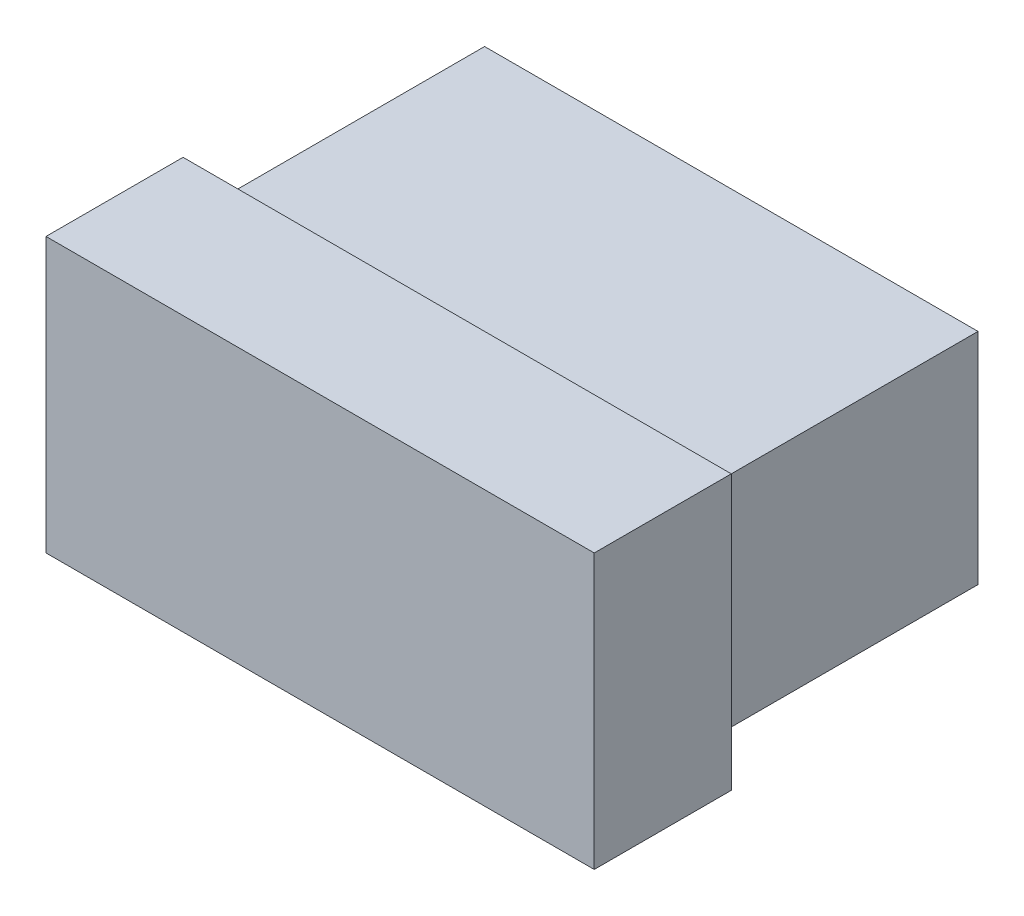
ISO-10303-21;
HEADER;
FILE_DESCRIPTION(('STEP AP214'),'2;1');
FILE_NAME('part.step','',(''),(''),'','','');
FILE_SCHEMA(('AUTOMOTIVE_DESIGN { 1 0 10303 214 1 1 1 1 }'));
ENDSEC;
DATA;
#1=APPLICATION_CONTEXT('core data for automotive mechanical design processes');
#2=APPLICATION_PROTOCOL_DEFINITION('international standard','automotive_design',2000,#1);
#3=PRODUCT_CONTEXT('',#1,'mechanical');
#4=PRODUCT('Part','Part','',(#3));
#5=PRODUCT_RELATED_PRODUCT_CATEGORY('part','',(#4));
#6=PRODUCT_DEFINITION_FORMATION('','',#4);
#7=PRODUCT_DEFINITION_CONTEXT('part definition',#1,'design');
#8=PRODUCT_DEFINITION('design','',#6,#7);
#9=PRODUCT_DEFINITION_SHAPE('','',#8);
#10=(LENGTH_UNIT() NAMED_UNIT(*) SI_UNIT(.MILLI.,.METRE.));
#11=(NAMED_UNIT(*) PLANE_ANGLE_UNIT() SI_UNIT($,.RADIAN.));
#12=(NAMED_UNIT(*) SI_UNIT($,.STERADIAN.) SOLID_ANGLE_UNIT());
#13=UNCERTAINTY_MEASURE_WITH_UNIT(LENGTH_MEASURE(1.E-05),#10,'distance_accuracy_value','');
#14=(GEOMETRIC_REPRESENTATION_CONTEXT(3) GLOBAL_UNCERTAINTY_ASSIGNED_CONTEXT((#13)) GLOBAL_UNIT_ASSIGNED_CONTEXT((#10,
#11,#12)) REPRESENTATION_CONTEXT('',''));
#15=CARTESIAN_POINT('',(0.,0.,0.));
#16=DIRECTION('',(0.,0.,1.));
#17=DIRECTION('',(1.,0.,0.));
#18=AXIS2_PLACEMENT_3D('',#15,#16,#17);
#19=CARTESIAN_POINT('',(-11.43,5.08,-12.7));
#20=DIRECTION('',(-1.,0.,0.));
#21=DIRECTION('',(0.,0.,1.));
#22=AXIS2_PLACEMENT_3D('',#19,#20,#21);
#23=PLANE('',#22);
#24=DIRECTION('',(0.,-1.,0.));
#25=VECTOR('',#24,1.);
#26=CARTESIAN_POINT('',(-11.43,5.08,0.));
#27=LINE('',#26,#25);
#28=CARTESIAN_POINT('',(-11.43,5.08,0.));
#29=VERTEX_POINT('',#28);
#30=CARTESIAN_POINT('',(-11.43,-5.08,0.));
#31=VERTEX_POINT('',#30);
#32=EDGE_CURVE('E142',#29,#31,#27,.T.);
#33=ORIENTED_EDGE('',*,*,#32,.F.);
#34=DIRECTION('',(0.,0.,1.));
#35=VECTOR('',#34,1.);
#36=CARTESIAN_POINT('',(-11.43,5.08,-12.7));
#37=LINE('',#36,#35);
#38=CARTESIAN_POINT('',(-11.43,5.08,-12.7));
#39=VERTEX_POINT('',#38);
#40=EDGE_CURVE('E11',#39,#29,#37,.T.);
#41=ORIENTED_EDGE('',*,*,#40,.F.);
#42=DIRECTION('',(0.,-1.,0.));
#43=VECTOR('',#42,1.);
#44=CARTESIAN_POINT('',(-11.43,5.08,-12.7));
#45=LINE('',#44,#43);
#46=CARTESIAN_POINT('',(-11.43,-5.08,-12.7));
#47=VERTEX_POINT('',#46);
#48=EDGE_CURVE('E153',#39,#47,#45,.T.);
#49=ORIENTED_EDGE('',*,*,#48,.T.);
#50=DIRECTION('',(0.,0.,1.));
#51=VECTOR('',#50,1.);
#52=CARTESIAN_POINT('',(-11.43,-5.08,-12.7));
#53=LINE('',#52,#51);
#54=EDGE_CURVE('E46',#47,#31,#53,.T.);
#55=ORIENTED_EDGE('',*,*,#54,.T.);
#56=EDGE_LOOP('',(#33,#41,#49,#55));
#57=FACE_BOUND('',#56,.T.);
#58=ADVANCED_FACE('F43',(#57),#23,.T.);
#59=CARTESIAN_POINT('',(-11.43,5.08,-12.7));
#60=DIRECTION('',(0.,1.,0.));
#61=DIRECTION('',(0.,0.,1.));
#62=AXIS2_PLACEMENT_3D('',#59,#60,#61);
#63=PLANE('',#62);
#64=DIRECTION('',(-1.,0.,0.));
#65=VECTOR('',#64,1.);
#66=CARTESIAN_POINT('',(-11.43,5.08,0.));
#67=LINE('',#66,#65);
#68=CARTESIAN_POINT('',(11.43,5.08,0.));
#69=VERTEX_POINT('',#68);
#70=EDGE_CURVE('E157',#69,#29,#67,.T.);
#71=ORIENTED_EDGE('',*,*,#70,.F.);
#72=DIRECTION('',(0.,0.,1.));
#73=VECTOR('',#72,1.);
#74=CARTESIAN_POINT('',(11.43,5.08,-12.7));
#75=LINE('',#74,#73);
#76=CARTESIAN_POINT('',(11.43,5.08,-12.7));
#77=VERTEX_POINT('',#76);
#78=EDGE_CURVE('E53',#77,#69,#75,.T.);
#79=ORIENTED_EDGE('',*,*,#78,.F.);
#80=DIRECTION('',(-1.,0.,0.));
#81=VECTOR('',#80,1.);
#82=CARTESIAN_POINT('',(-11.43,5.08,-12.7));
#83=LINE('',#82,#81);
#84=EDGE_CURVE('E163',#77,#39,#83,.T.);
#85=ORIENTED_EDGE('',*,*,#84,.T.);
#86=ORIENTED_EDGE('',*,*,#40,.T.);
#87=EDGE_LOOP('',(#71,#79,#85,#86));
#88=FACE_BOUND('',#87,.T.);
#89=ADVANCED_FACE('F184',(#88),#63,.T.);
#90=CARTESIAN_POINT('',(11.43,5.08,-12.7));
#91=DIRECTION('',(1.,0.,0.));
#92=DIRECTION('',(0.,0.,-1.));
#93=AXIS2_PLACEMENT_3D('',#90,#91,#92);
#94=PLANE('',#93);
#95=DIRECTION('',(0.,1.,0.));
#96=VECTOR('',#95,1.);
#97=CARTESIAN_POINT('',(11.43,5.08,0.));
#98=LINE('',#97,#96);
#99=CARTESIAN_POINT('',(11.43,-5.08,0.));
#100=VERTEX_POINT('',#99);
#101=EDGE_CURVE('E170',#100,#69,#98,.T.);
#102=ORIENTED_EDGE('',*,*,#101,.F.);
#103=DIRECTION('',(0.,0.,1.));
#104=VECTOR('',#103,1.);
#105=CARTESIAN_POINT('',(11.43,-5.08,-12.7));
#106=LINE('',#105,#104);
#107=CARTESIAN_POINT('',(11.43,-5.08,-12.7));
#108=VERTEX_POINT('',#107);
#109=EDGE_CURVE('E76',#108,#100,#106,.T.);
#110=ORIENTED_EDGE('',*,*,#109,.F.);
#111=DIRECTION('',(0.,1.,0.));
#112=VECTOR('',#111,1.);
#113=CARTESIAN_POINT('',(11.43,5.08,-12.7));
#114=LINE('',#113,#112);
#115=EDGE_CURVE('E160',#108,#77,#114,.T.);
#116=ORIENTED_EDGE('',*,*,#115,.T.);
#117=ORIENTED_EDGE('',*,*,#78,.T.);
#118=EDGE_LOOP('',(#102,#110,#116,#117));
#119=FACE_BOUND('',#118,.T.);
#120=ADVANCED_FACE('F189',(#119),#94,.T.);
#121=CARTESIAN_POINT('',(-11.43,-5.08,-12.7));
#122=DIRECTION('',(0.,-1.,0.));
#123=DIRECTION('',(1.,0.,0.));
#124=AXIS2_PLACEMENT_3D('',#121,#122,#123);
#125=PLANE('',#124);
#126=DIRECTION('',(1.,0.,0.));
#127=VECTOR('',#126,1.);
#128=CARTESIAN_POINT('',(-11.43,-5.08,0.));
#129=LINE('',#128,#127);
#130=EDGE_CURVE('E147',#31,#100,#129,.T.);
#131=ORIENTED_EDGE('',*,*,#130,.F.);
#132=ORIENTED_EDGE('',*,*,#54,.F.);
#133=DIRECTION('',(1.,0.,0.));
#134=VECTOR('',#133,1.);
#135=CARTESIAN_POINT('',(-11.43,-5.08,-12.7));
#136=LINE('',#135,#134);
#137=EDGE_CURVE('E156',#47,#108,#136,.T.);
#138=ORIENTED_EDGE('',*,*,#137,.T.);
#139=ORIENTED_EDGE('',*,*,#109,.T.);
#140=EDGE_LOOP('',(#131,#132,#138,#139));
#141=FACE_BOUND('',#140,.T.);
#142=ADVANCED_FACE('F180',(#141),#125,.T.);
#143=CARTESIAN_POINT('',(0.,0.,-12.7));
#144=DIRECTION('',(0.,0.,1.));
#145=DIRECTION('',(1.,0.,0.));
#146=AXIS2_PLACEMENT_3D('',#143,#144,#145);
#147=PLANE('',#146);
#148=ORIENTED_EDGE('',*,*,#48,.F.);
#149=ORIENTED_EDGE('',*,*,#84,.F.);
#150=ORIENTED_EDGE('',*,*,#115,.F.);
#151=ORIENTED_EDGE('',*,*,#137,.F.);
#152=EDGE_LOOP('',(#148,#149,#150,#151));
#153=FACE_BOUND('',#152,.T.);
#154=ADVANCED_FACE('F188',(#153),#147,.F.);
#155=CARTESIAN_POINT('',(0.,0.,0.));
#156=DIRECTION('',(0.,0.,1.));
#157=DIRECTION('',(1.,0.,0.));
#158=AXIS2_PLACEMENT_3D('',#155,#156,#157);
#159=PLANE('',#158);
#160=DIRECTION('',(0.,-1.,0.));
#161=VECTOR('',#160,1.);
#162=CARTESIAN_POINT('',(-12.7,6.35,0.));
#163=LINE('',#162,#161);
#164=CARTESIAN_POINT('',(-12.7,6.35,0.));
#165=VERTEX_POINT('',#164);
#166=CARTESIAN_POINT('',(-12.7,-6.35,0.));
#167=VERTEX_POINT('',#166);
#168=EDGE_CURVE('E140',#165,#167,#163,.T.);
#169=ORIENTED_EDGE('',*,*,#168,.F.);
#170=DIRECTION('',(-1.,0.,0.));
#171=VECTOR('',#170,1.);
#172=CARTESIAN_POINT('',(-12.7,6.35,0.));
#173=LINE('',#172,#171);
#174=CARTESIAN_POINT('',(12.7,6.35,0.));
#175=VERTEX_POINT('',#174);
#176=EDGE_CURVE('E136',#175,#165,#173,.T.);
#177=ORIENTED_EDGE('',*,*,#176,.F.);
#178=DIRECTION('',(0.,1.,0.));
#179=VECTOR('',#178,1.);
#180=CARTESIAN_POINT('',(12.7,6.35,0.));
#181=LINE('',#180,#179);
#182=CARTESIAN_POINT('',(12.7,-6.35,0.));
#183=VERTEX_POINT('',#182);
#184=EDGE_CURVE('E309',#183,#175,#181,.T.);
#185=ORIENTED_EDGE('',*,*,#184,.F.);
#186=DIRECTION('',(1.,0.,0.));
#187=VECTOR('',#186,1.);
#188=CARTESIAN_POINT('',(-12.7,-6.35,0.));
#189=LINE('',#188,#187);
#190=EDGE_CURVE('E313',#167,#183,#189,.T.);
#191=ORIENTED_EDGE('',*,*,#190,.F.);
#192=EDGE_LOOP('',(#169,#177,#185,#191));
#193=FACE_BOUND('',#192,.T.);
#194=ORIENTED_EDGE('',*,*,#70,.T.);
#195=ORIENTED_EDGE('',*,*,#32,.T.);
#196=ORIENTED_EDGE('',*,*,#130,.T.);
#197=ORIENTED_EDGE('',*,*,#101,.T.);
#198=EDGE_LOOP('',(#194,#195,#196,#197));
#199=FACE_BOUND('',#198,.T.);
#200=ADVANCED_FACE('F182',(#193,#199),#159,.F.);
#201=CARTESIAN_POINT('',(-12.7,6.35,6.35));
#202=DIRECTION('',(1.,0.,0.));
#203=DIRECTION('',(0.,0.,-1.));
#204=AXIS2_PLACEMENT_3D('',#201,#202,#203);
#205=PLANE('',#204);
#206=ORIENTED_EDGE('',*,*,#168,.T.);
#207=DIRECTION('',(0.,0.,-1.));
#208=VECTOR('',#207,1.);
#209=CARTESIAN_POINT('',(-12.7,-6.35,6.35));
#210=LINE('',#209,#208);
#211=CARTESIAN_POINT('',(-12.7,-6.35,6.35));
#212=VERTEX_POINT('',#211);
#213=EDGE_CURVE('E118',#212,#167,#210,.T.);
#214=ORIENTED_EDGE('',*,*,#213,.F.);
#215=DIRECTION('',(0.,-1.,0.));
#216=VECTOR('',#215,1.);
#217=CARTESIAN_POINT('',(-12.7,6.35,6.35));
#218=LINE('',#217,#216);
#219=CARTESIAN_POINT('',(-12.7,6.35,6.35));
#220=VERTEX_POINT('',#219);
#221=EDGE_CURVE('E126',#220,#212,#218,.T.);
#222=ORIENTED_EDGE('',*,*,#221,.F.);
#223=DIRECTION('',(0.,0.,-1.));
#224=VECTOR('',#223,1.);
#225=CARTESIAN_POINT('',(-12.7,6.35,6.35));
#226=LINE('',#225,#224);
#227=EDGE_CURVE('E305',#220,#165,#226,.T.);
#228=ORIENTED_EDGE('',*,*,#227,.T.);
#229=EDGE_LOOP('',(#206,#214,#222,#228));
#230=FACE_BOUND('',#229,.T.);
#231=ADVANCED_FACE('F138',(#230),#205,.F.);
#232=CARTESIAN_POINT('',(-12.7,-6.35,6.35));
#233=DIRECTION('',(0.,1.,0.));
#234=DIRECTION('',(0.,0.,1.));
#235=AXIS2_PLACEMENT_3D('',#232,#233,#234);
#236=PLANE('',#235);
#237=ORIENTED_EDGE('',*,*,#190,.T.);
#238=DIRECTION('',(0.,0.,-1.));
#239=VECTOR('',#238,1.);
#240=CARTESIAN_POINT('',(12.7,-6.35,6.35));
#241=LINE('',#240,#239);
#242=CARTESIAN_POINT('',(12.7,-6.35,6.35));
#243=VERTEX_POINT('',#242);
#244=EDGE_CURVE('E121',#243,#183,#241,.T.);
#245=ORIENTED_EDGE('',*,*,#244,.F.);
#246=DIRECTION('',(1.,0.,0.));
#247=VECTOR('',#246,1.);
#248=CARTESIAN_POINT('',(-12.7,-6.35,6.35));
#249=LINE('',#248,#247);
#250=EDGE_CURVE('E114',#212,#243,#249,.T.);
#251=ORIENTED_EDGE('',*,*,#250,.F.);
#252=ORIENTED_EDGE('',*,*,#213,.T.);
#253=EDGE_LOOP('',(#237,#245,#251,#252));
#254=FACE_BOUND('',#253,.T.);
#255=ADVANCED_FACE('F116',(#254),#236,.F.);
#256=CARTESIAN_POINT('',(12.7,6.35,6.35));
#257=DIRECTION('',(-1.,0.,0.));
#258=DIRECTION('',(0.,0.,1.));
#259=AXIS2_PLACEMENT_3D('',#256,#257,#258);
#260=PLANE('',#259);
#261=ORIENTED_EDGE('',*,*,#184,.T.);
#262=DIRECTION('',(0.,0.,-1.));
#263=VECTOR('',#262,1.);
#264=CARTESIAN_POINT('',(12.7,6.35,6.35));
#265=LINE('',#264,#263);
#266=CARTESIAN_POINT('',(12.7,6.35,6.35));
#267=VERTEX_POINT('',#266);
#268=EDGE_CURVE('E149',#267,#175,#265,.T.);
#269=ORIENTED_EDGE('',*,*,#268,.F.);
#270=DIRECTION('',(0.,1.,0.));
#271=VECTOR('',#270,1.);
#272=CARTESIAN_POINT('',(12.7,6.35,6.35));
#273=LINE('',#272,#271);
#274=EDGE_CURVE('E125',#243,#267,#273,.T.);
#275=ORIENTED_EDGE('',*,*,#274,.F.);
#276=ORIENTED_EDGE('',*,*,#244,.T.);
#277=EDGE_LOOP('',(#261,#269,#275,#276));
#278=FACE_BOUND('',#277,.T.);
#279=ADVANCED_FACE('F248',(#278),#260,.F.);
#280=CARTESIAN_POINT('',(-12.7,6.35,6.35));
#281=DIRECTION('',(0.,-1.,0.));
#282=DIRECTION('',(0.,0.,-1.));
#283=AXIS2_PLACEMENT_3D('',#280,#281,#282);
#284=PLANE('',#283);
#285=ORIENTED_EDGE('',*,*,#176,.T.);
#286=ORIENTED_EDGE('',*,*,#227,.F.);
#287=DIRECTION('',(-1.,0.,0.));
#288=VECTOR('',#287,1.);
#289=CARTESIAN_POINT('',(-12.7,6.35,6.35));
#290=LINE('',#289,#288);
#291=EDGE_CURVE('E131',#267,#220,#290,.T.);
#292=ORIENTED_EDGE('',*,*,#291,.F.);
#293=ORIENTED_EDGE('',*,*,#268,.T.);
#294=EDGE_LOOP('',(#285,#286,#292,#293));
#295=FACE_BOUND('',#294,.T.);
#296=ADVANCED_FACE('F258',(#295),#284,.F.);
#297=CARTESIAN_POINT('',(0.,0.,6.35));
#298=DIRECTION('',(0.,0.,1.));
#299=DIRECTION('',(1.,0.,0.));
#300=AXIS2_PLACEMENT_3D('',#297,#298,#299);
#301=PLANE('',#300);
#302=ORIENTED_EDGE('',*,*,#221,.T.);
#303=ORIENTED_EDGE('',*,*,#250,.T.);
#304=ORIENTED_EDGE('',*,*,#274,.T.);
#305=ORIENTED_EDGE('',*,*,#291,.T.);
#306=EDGE_LOOP('',(#302,#303,#304,#305));
#307=FACE_BOUND('',#306,.T.);
#308=ADVANCED_FACE('F129',(#307),#301,.T.);
#309=CLOSED_SHELL('',(#58,#89,#120,#142,#154,#200,#231,#255,#279,#296,#308));
#310=MANIFOLD_SOLID_BREP('B2',#309);
#311=ADVANCED_BREP_SHAPE_REPRESENTATION('',(#18,#310),#14);
#312=SHAPE_DEFINITION_REPRESENTATION(#9,#311);
ENDSEC;
END-ISO-10303-21;
